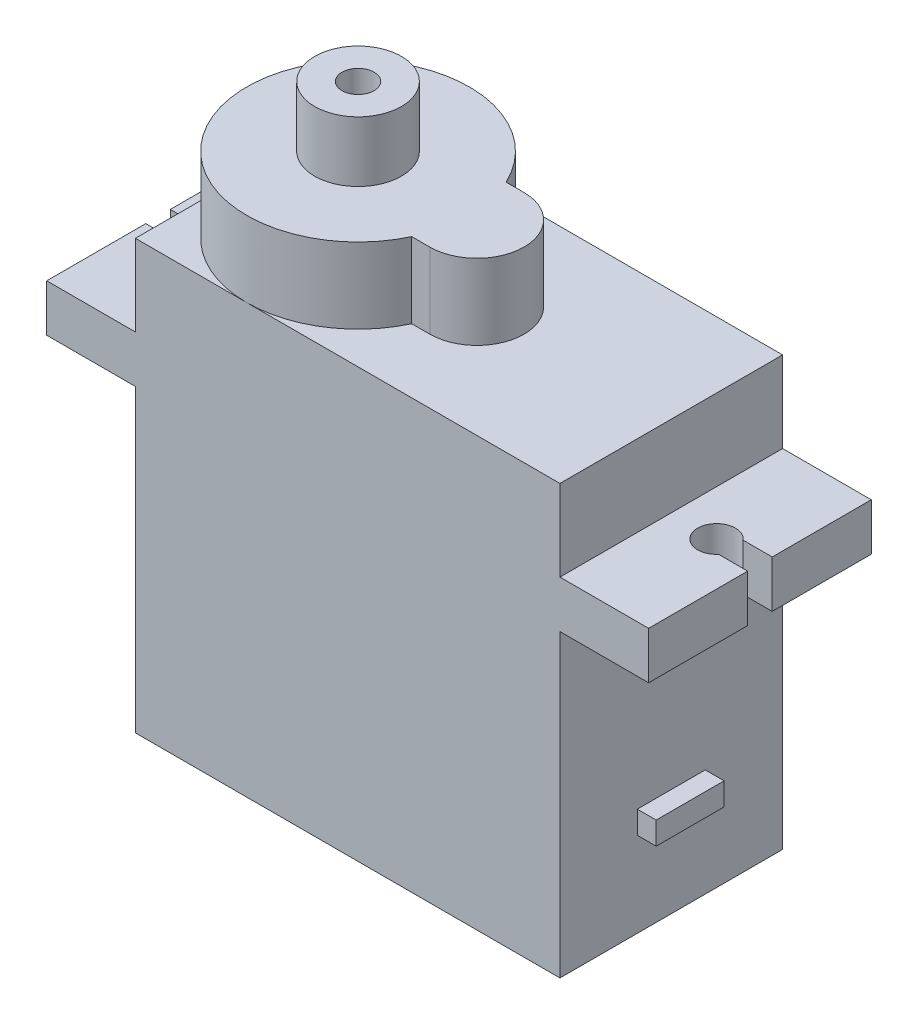
ISO-10303-21;
HEADER;
FILE_DESCRIPTION(('STEP AP214'),'2;1');
FILE_NAME('part.step','',(''),(''),'','','');
FILE_SCHEMA(('AUTOMOTIVE_DESIGN { 1 0 10303 214 1 1 1 1 }'));
ENDSEC;
DATA;
#1=APPLICATION_CONTEXT('core data for automotive mechanical design processes');
#2=APPLICATION_PROTOCOL_DEFINITION('international standard','automotive_design',2000,#1);
#3=PRODUCT_CONTEXT('',#1,'mechanical');
#4=PRODUCT('Part','Part','',(#3));
#5=PRODUCT_RELATED_PRODUCT_CATEGORY('part','',(#4));
#6=PRODUCT_DEFINITION_FORMATION('','',#4);
#7=PRODUCT_DEFINITION_CONTEXT('part definition',#1,'design');
#8=PRODUCT_DEFINITION('design','',#6,#7);
#9=PRODUCT_DEFINITION_SHAPE('','',#8);
#10=(LENGTH_UNIT() NAMED_UNIT(*) SI_UNIT(.MILLI.,.METRE.));
#11=(NAMED_UNIT(*) PLANE_ANGLE_UNIT() SI_UNIT($,.RADIAN.));
#12=(NAMED_UNIT(*) SI_UNIT($,.STERADIAN.) SOLID_ANGLE_UNIT());
#13=UNCERTAINTY_MEASURE_WITH_UNIT(LENGTH_MEASURE(1.E-05),#10,'distance_accuracy_value','');
#14=(GEOMETRIC_REPRESENTATION_CONTEXT(3) GLOBAL_UNCERTAINTY_ASSIGNED_CONTEXT((#13)) GLOBAL_UNIT_ASSIGNED_CONTEXT((#10,
#11,#12)) REPRESENTATION_CONTEXT('',''));
#15=CARTESIAN_POINT('',(0.,0.,0.));
#16=DIRECTION('',(0.,0.,1.));
#17=DIRECTION('',(1.,0.,0.));
#18=AXIS2_PLACEMENT_3D('',#15,#16,#17);
#19=CARTESIAN_POINT('',(11.25,22.7,5.9));
#20=DIRECTION('',(-1.,0.,0.));
#21=DIRECTION('',(0.,0.,1.));
#22=AXIS2_PLACEMENT_3D('',#19,#20,#21);
#23=PLANE('',#22);
#24=DIRECTION('',(0.,-1.,0.));
#25=VECTOR('',#24,1.);
#26=CARTESIAN_POINT('',(11.25,22.7,-5.9));
#27=LINE('',#26,#25);
#28=CARTESIAN_POINT('',(11.25,15.9,-5.9));
#29=VERTEX_POINT('',#28);
#30=CARTESIAN_POINT('',(11.25,0.,-5.9));
#31=VERTEX_POINT('',#30);
#32=EDGE_CURVE('E439',#29,#31,#27,.T.);
#33=ORIENTED_EDGE('',*,*,#32,.F.);
#34=DIRECTION('',(0.,0.,1.));
#35=VECTOR('',#34,1.);
#36=CARTESIAN_POINT('',(11.25,15.9,0.));
#37=LINE('',#36,#35);
#38=CARTESIAN_POINT('',(11.25,15.9,5.9));
#39=VERTEX_POINT('',#38);
#40=EDGE_CURVE('E384',#29,#39,#37,.T.);
#41=ORIENTED_EDGE('',*,*,#40,.T.);
#42=DIRECTION('',(0.,-1.,0.));
#43=VECTOR('',#42,1.);
#44=CARTESIAN_POINT('',(11.25,22.7,5.9));
#45=LINE('',#44,#43);
#46=CARTESIAN_POINT('',(11.25,0.,5.9));
#47=VERTEX_POINT('',#46);
#48=EDGE_CURVE('E419',#39,#47,#45,.T.);
#49=ORIENTED_EDGE('',*,*,#48,.T.);
#50=DIRECTION('',(0.,0.,-1.));
#51=VECTOR('',#50,1.);
#52=CARTESIAN_POINT('',(11.25,0.,5.9));
#53=LINE('',#52,#51);
#54=EDGE_CURVE('E402',#47,#31,#53,.T.);
#55=ORIENTED_EDGE('',*,*,#54,.T.);
#56=EDGE_LOOP('',(#33,#41,#49,#55));
#57=FACE_BOUND('',#56,.T.);
#58=DIRECTION('',(0.,1.,0.));
#59=VECTOR('',#58,1.);
#60=CARTESIAN_POINT('',(11.25,4.5,-1.8));
#61=LINE('',#60,#59);
#62=CARTESIAN_POINT('',(11.25,4.5,-1.8));
#63=VERTEX_POINT('',#62);
#64=CARTESIAN_POINT('',(11.25,5.7,-1.8));
#65=VERTEX_POINT('',#64);
#66=EDGE_CURVE('E247',#63,#65,#61,.T.);
#67=ORIENTED_EDGE('',*,*,#66,.F.);
#68=DIRECTION('',(0.,0.,-1.));
#69=VECTOR('',#68,1.);
#70=CARTESIAN_POINT('',(11.25,4.5,1.8));
#71=LINE('',#70,#69);
#72=CARTESIAN_POINT('',(11.25,4.5,1.8));
#73=VERTEX_POINT('',#72);
#74=EDGE_CURVE('E244',#73,#63,#71,.T.);
#75=ORIENTED_EDGE('',*,*,#74,.F.);
#76=DIRECTION('',(0.,-1.,0.));
#77=VECTOR('',#76,1.);
#78=CARTESIAN_POINT('',(11.25,4.5,1.8));
#79=LINE('',#78,#77);
#80=CARTESIAN_POINT('',(11.25,5.7,1.8));
#81=VERTEX_POINT('',#80);
#82=EDGE_CURVE('E53',#81,#73,#79,.T.);
#83=ORIENTED_EDGE('',*,*,#82,.F.);
#84=DIRECTION('',(0.,0.,1.));
#85=VECTOR('',#84,1.);
#86=CARTESIAN_POINT('',(11.25,5.7,1.8));
#87=LINE('',#86,#85);
#88=EDGE_CURVE('E48',#65,#81,#87,.T.);
#89=ORIENTED_EDGE('',*,*,#88,.F.);
#90=EDGE_LOOP('',(#67,#75,#83,#89));
#91=FACE_BOUND('',#90,.T.);
#92=ADVANCED_FACE('F34',(#57,#91),#23,.F.);
#93=CARTESIAN_POINT('',(0.,22.7,0.));
#94=DIRECTION('',(0.,-1.,0.));
#95=DIRECTION('',(0.,0.,-1.));
#96=AXIS2_PLACEMENT_3D('',#93,#94,#95);
#97=PLANE('',#96);
#98=CARTESIAN_POINT('',(-5.35,22.7,0.));
#99=DIRECTION('',(0.,1.,0.));
#100=DIRECTION('',(0.,0.,1.));
#101=AXIS2_PLACEMENT_3D('',#98,#99,#100);
#102=CIRCLE('',#101,5.9);
#103=CARTESIAN_POINT('',(-11.25,22.7,0.));
#104=VERTEX_POINT('',#103);
#105=CARTESIAN_POINT('',(-5.35,22.7,5.9));
#106=VERTEX_POINT('',#105);
#107=EDGE_CURVE('E41',#104,#106,#102,.T.);
#108=ORIENTED_EDGE('',*,*,#107,.F.);
#109=DIRECTION('',(0.,0.,1.));
#110=VECTOR('',#109,1.);
#111=CARTESIAN_POINT('',(-11.25,22.7,5.9));
#112=LINE('',#111,#110);
#113=CARTESIAN_POINT('',(-11.25,22.7,5.9));
#114=VERTEX_POINT('',#113);
#115=EDGE_CURVE('E411',#104,#114,#112,.T.);
#116=ORIENTED_EDGE('',*,*,#115,.T.);
#117=DIRECTION('',(1.,0.,0.));
#118=VECTOR('',#117,1.);
#119=CARTESIAN_POINT('',(-11.25,22.7,5.9));
#120=LINE('',#119,#118);
#121=EDGE_CURVE('E416',#114,#106,#120,.T.);
#122=ORIENTED_EDGE('',*,*,#121,.T.);
#123=EDGE_LOOP('',(#108,#116,#122));
#124=FACE_BOUND('',#123,.T.);
#125=ADVANCED_FACE('F538',(#124),#97,.F.);
#126=CARTESIAN_POINT('',(-0.00584431364504361,22.7,2.5));
#127=VERTEX_POINT('',#126);
#128=EDGE_CURVE('E446',#106,#127,#102,.T.);
#129=ORIENTED_EDGE('',*,*,#128,.F.);
#130=CARTESIAN_POINT('',(11.25,22.7,5.9));
#131=VERTEX_POINT('',#130);
#132=EDGE_CURVE('E415',#106,#131,#120,.T.);
#133=ORIENTED_EDGE('',*,*,#132,.T.);
#134=DIRECTION('',(0.,0.,-1.));
#135=VECTOR('',#134,1.);
#136=CARTESIAN_POINT('',(11.25,22.7,5.9));
#137=LINE('',#136,#135);
#138=CARTESIAN_POINT('',(11.25,22.7,-5.9));
#139=VERTEX_POINT('',#138);
#140=EDGE_CURVE('E403',#131,#139,#137,.T.);
#141=ORIENTED_EDGE('',*,*,#140,.T.);
#142=DIRECTION('',(-1.,0.,0.));
#143=VECTOR('',#142,1.);
#144=CARTESIAN_POINT('',(-11.25,22.7,-5.9));
#145=LINE('',#144,#143);
#146=CARTESIAN_POINT('',(-5.35,22.7,-5.9));
#147=VERTEX_POINT('',#146);
#148=EDGE_CURVE('E408',#139,#147,#145,.T.);
#149=ORIENTED_EDGE('',*,*,#148,.T.);
#150=CARTESIAN_POINT('',(-0.00584431364504361,22.7,-2.5));
#151=VERTEX_POINT('',#150);
#152=EDGE_CURVE('E280',#151,#147,#102,.T.);
#153=ORIENTED_EDGE('',*,*,#152,.F.);
#154=DIRECTION('',(-1.,0.,0.));
#155=VECTOR('',#154,1.);
#156=CARTESIAN_POINT('',(0.,22.7,-2.5));
#157=LINE('',#156,#155);
#158=CARTESIAN_POINT('',(0.95,22.7,-2.5));
#159=VERTEX_POINT('',#158);
#160=EDGE_CURVE('E277',#159,#151,#157,.T.);
#161=ORIENTED_EDGE('',*,*,#160,.F.);
#162=CARTESIAN_POINT('',(0.95,22.7,0.));
#163=DIRECTION('',(0.,1.,0.));
#164=DIRECTION('',(0.,0.,1.));
#165=AXIS2_PLACEMENT_3D('',#162,#163,#164);
#166=CIRCLE('',#165,2.5);
#167=CARTESIAN_POINT('',(0.95,22.7,2.5));
#168=VERTEX_POINT('',#167);
#169=EDGE_CURVE('E260',#168,#159,#166,.T.);
#170=ORIENTED_EDGE('',*,*,#169,.F.);
#171=DIRECTION('',(-1.,0.,0.));
#172=VECTOR('',#171,1.);
#173=CARTESIAN_POINT('',(0.,22.7,2.5));
#174=LINE('',#173,#172);
#175=EDGE_CURVE('E267',#168,#127,#174,.T.);
#176=ORIENTED_EDGE('',*,*,#175,.T.);
#177=EDGE_LOOP('',(#129,#133,#141,#149,#153,#161,#170,#176));
#178=FACE_BOUND('',#177,.T.);
#179=ADVANCED_FACE('F504',(#178),#97,.F.);
#180=EDGE_CURVE('E283',#147,#104,#102,.T.);
#181=ORIENTED_EDGE('',*,*,#180,.F.);
#182=CARTESIAN_POINT('',(-11.25,22.7,-5.9));
#183=VERTEX_POINT('',#182);
#184=EDGE_CURVE('E406',#147,#183,#145,.T.);
#185=ORIENTED_EDGE('',*,*,#184,.T.);
#186=EDGE_CURVE('E412',#183,#104,#112,.T.);
#187=ORIENTED_EDGE('',*,*,#186,.T.);
#188=EDGE_LOOP('',(#181,#185,#187));
#189=FACE_BOUND('',#188,.T.);
#190=ADVANCED_FACE('F496',(#189),#97,.F.);
#191=CARTESIAN_POINT('',(-11.25,22.7,5.9));
#192=DIRECTION('',(1.,0.,0.));
#193=DIRECTION('',(0.,0.,-1.));
#194=AXIS2_PLACEMENT_3D('',#191,#192,#193);
#195=PLANE('',#194);
#196=DIRECTION('',(0.,0.,1.));
#197=VECTOR('',#196,1.);
#198=CARTESIAN_POINT('',(-11.25,15.9,0.));
#199=LINE('',#198,#197);
#200=CARTESIAN_POINT('',(-11.25,15.9,-5.9));
#201=VERTEX_POINT('',#200);
#202=CARTESIAN_POINT('',(-11.25,15.9,5.9));
#203=VERTEX_POINT('',#202);
#204=EDGE_CURVE('E329',#201,#203,#199,.T.);
#205=ORIENTED_EDGE('',*,*,#204,.F.);
#206=DIRECTION('',(0.,-1.,0.));
#207=VECTOR('',#206,1.);
#208=CARTESIAN_POINT('',(-11.25,22.7,-5.9));
#209=LINE('',#208,#207);
#210=CARTESIAN_POINT('',(-11.25,0.,-5.9));
#211=VERTEX_POINT('',#210);
#212=EDGE_CURVE('E436',#201,#211,#209,.T.);
#213=ORIENTED_EDGE('',*,*,#212,.T.);
#214=DIRECTION('',(0.,0.,1.));
#215=VECTOR('',#214,1.);
#216=CARTESIAN_POINT('',(-11.25,0.,5.9));
#217=LINE('',#216,#215);
#218=CARTESIAN_POINT('',(-11.25,0.,5.9));
#219=VERTEX_POINT('',#218);
#220=EDGE_CURVE('E425',#211,#219,#217,.T.);
#221=ORIENTED_EDGE('',*,*,#220,.T.);
#222=DIRECTION('',(0.,-1.,0.));
#223=VECTOR('',#222,1.);
#224=CARTESIAN_POINT('',(-11.25,22.7,5.9));
#225=LINE('',#224,#223);
#226=EDGE_CURVE('E432',#203,#219,#225,.T.);
#227=ORIENTED_EDGE('',*,*,#226,.F.);
#228=EDGE_LOOP('',(#205,#213,#221,#227));
#229=FACE_BOUND('',#228,.T.);
#230=ADVANCED_FACE('F465',(#229),#195,.F.);
#231=DIRECTION('',(0.,0.,1.));
#232=VECTOR('',#231,1.);
#233=CARTESIAN_POINT('',(11.25,18.4,0.));
#234=LINE('',#233,#232);
#235=CARTESIAN_POINT('',(11.25,18.4,-5.9));
#236=VERTEX_POINT('',#235);
#237=CARTESIAN_POINT('',(11.25,18.4,5.9));
#238=VERTEX_POINT('',#237);
#239=EDGE_CURVE('E364',#236,#238,#234,.T.);
#240=ORIENTED_EDGE('',*,*,#239,.F.);
#241=EDGE_CURVE('E440',#139,#236,#27,.T.);
#242=ORIENTED_EDGE('',*,*,#241,.F.);
#243=ORIENTED_EDGE('',*,*,#140,.F.);
#244=EDGE_CURVE('E430',#131,#238,#45,.T.);
#245=ORIENTED_EDGE('',*,*,#244,.T.);
#246=EDGE_LOOP('',(#240,#242,#243,#245));
#247=FACE_BOUND('',#246,.T.);
#248=ADVANCED_FACE('F539',(#247),#23,.F.);
#249=CARTESIAN_POINT('',(-11.25,22.7,-5.9));
#250=DIRECTION('',(0.,0.,1.));
#251=DIRECTION('',(1.,0.,0.));
#252=AXIS2_PLACEMENT_3D('',#249,#250,#251);
#253=PLANE('',#252);
#254=DIRECTION('',(-1.,0.,0.));
#255=VECTOR('',#254,1.);
#256=CARTESIAN_POINT('',(-11.25,0.,-5.9));
#257=LINE('',#256,#255);
#258=EDGE_CURVE('E422',#31,#211,#257,.T.);
#259=ORIENTED_EDGE('',*,*,#258,.T.);
#260=ORIENTED_EDGE('',*,*,#212,.F.);
#261=DIRECTION('',(-1.,0.,0.));
#262=VECTOR('',#261,1.);
#263=CARTESIAN_POINT('',(0.,15.9,-5.9));
#264=LINE('',#263,#262);
#265=CARTESIAN_POINT('',(-15.95,15.9,-5.9));
#266=VERTEX_POINT('',#265);
#267=EDGE_CURVE('E332',#201,#266,#264,.T.);
#268=ORIENTED_EDGE('',*,*,#267,.T.);
#269=DIRECTION('',(0.,-1.,0.));
#270=VECTOR('',#269,1.);
#271=CARTESIAN_POINT('',(-15.95,18.4,-5.9));
#272=LINE('',#271,#270);
#273=CARTESIAN_POINT('',(-15.95,18.4,-5.9));
#274=VERTEX_POINT('',#273);
#275=EDGE_CURVE('E340',#274,#266,#272,.T.);
#276=ORIENTED_EDGE('',*,*,#275,.F.);
#277=DIRECTION('',(-1.,0.,0.));
#278=VECTOR('',#277,1.);
#279=CARTESIAN_POINT('',(0.,18.4,-5.9));
#280=LINE('',#279,#278);
#281=CARTESIAN_POINT('',(-11.25,18.4,-5.9));
#282=VERTEX_POINT('',#281);
#283=EDGE_CURVE('E312',#282,#274,#280,.T.);
#284=ORIENTED_EDGE('',*,*,#283,.F.);
#285=EDGE_CURVE('E437',#183,#282,#209,.T.);
#286=ORIENTED_EDGE('',*,*,#285,.F.);
#287=ORIENTED_EDGE('',*,*,#184,.F.);
#288=ORIENTED_EDGE('',*,*,#148,.F.);
#289=ORIENTED_EDGE('',*,*,#241,.T.);
#290=DIRECTION('',(1.,0.,0.));
#291=VECTOR('',#290,1.);
#292=CARTESIAN_POINT('',(0.,18.4,-5.9));
#293=LINE('',#292,#291);
#294=CARTESIAN_POINT('',(15.95,18.4,-5.9));
#295=VERTEX_POINT('',#294);
#296=EDGE_CURVE('E360',#236,#295,#293,.T.);
#297=ORIENTED_EDGE('',*,*,#296,.T.);
#298=DIRECTION('',(0.,-1.,0.));
#299=VECTOR('',#298,1.);
#300=CARTESIAN_POINT('',(15.95,18.4,-5.9));
#301=LINE('',#300,#299);
#302=CARTESIAN_POINT('',(15.95,15.9,-5.9));
#303=VERTEX_POINT('',#302);
#304=EDGE_CURVE('E396',#295,#303,#301,.T.);
#305=ORIENTED_EDGE('',*,*,#304,.T.);
#306=DIRECTION('',(1.,0.,0.));
#307=VECTOR('',#306,1.);
#308=CARTESIAN_POINT('',(0.,15.9,-5.9));
#309=LINE('',#308,#307);
#310=EDGE_CURVE('E380',#29,#303,#309,.T.);
#311=ORIENTED_EDGE('',*,*,#310,.F.);
#312=ORIENTED_EDGE('',*,*,#32,.T.);
#313=EDGE_LOOP('',(#259,#260,#268,#276,#284,#286,#287,#288,#289,#297,#305,#311,#312));
#314=FACE_BOUND('',#313,.T.);
#315=ADVANCED_FACE('F449',(#314),#253,.F.);
#316=ORIENTED_EDGE('',*,*,#285,.T.);
#317=DIRECTION('',(0.,0.,1.));
#318=VECTOR('',#317,1.);
#319=CARTESIAN_POINT('',(-11.25,18.4,0.));
#320=LINE('',#319,#318);
#321=CARTESIAN_POINT('',(-11.25,18.4,5.9));
#322=VERTEX_POINT('',#321);
#323=EDGE_CURVE('E309',#282,#322,#320,.T.);
#324=ORIENTED_EDGE('',*,*,#323,.T.);
#325=EDGE_CURVE('E433',#114,#322,#225,.T.);
#326=ORIENTED_EDGE('',*,*,#325,.F.);
#327=ORIENTED_EDGE('',*,*,#115,.F.);
#328=ORIENTED_EDGE('',*,*,#186,.F.);
#329=EDGE_LOOP('',(#316,#324,#326,#327,#328));
#330=FACE_BOUND('',#329,.T.);
#331=ADVANCED_FACE('F493',(#330),#195,.F.);
#332=CARTESIAN_POINT('',(-11.25,22.7,5.9));
#333=DIRECTION('',(0.,0.,-1.));
#334=DIRECTION('',(-1.,0.,0.));
#335=AXIS2_PLACEMENT_3D('',#332,#333,#334);
#336=PLANE('',#335);
#337=DIRECTION('',(1.,0.,0.));
#338=VECTOR('',#337,1.);
#339=CARTESIAN_POINT('',(-11.25,0.,5.9));
#340=LINE('',#339,#338);
#341=EDGE_CURVE('E407',#219,#47,#340,.T.);
#342=ORIENTED_EDGE('',*,*,#341,.T.);
#343=ORIENTED_EDGE('',*,*,#48,.F.);
#344=DIRECTION('',(1.,0.,0.));
#345=VECTOR('',#344,1.);
#346=CARTESIAN_POINT('',(0.,15.9,5.9));
#347=LINE('',#346,#345);
#348=CARTESIAN_POINT('',(15.95,15.9,5.9));
#349=VERTEX_POINT('',#348);
#350=EDGE_CURVE('E386',#39,#349,#347,.T.);
#351=ORIENTED_EDGE('',*,*,#350,.T.);
#352=DIRECTION('',(0.,-1.,0.));
#353=VECTOR('',#352,1.);
#354=CARTESIAN_POINT('',(15.95,18.4,5.9));
#355=LINE('',#354,#353);
#356=CARTESIAN_POINT('',(15.95,18.4,5.9));
#357=VERTEX_POINT('',#356);
#358=EDGE_CURVE('E394',#357,#349,#355,.T.);
#359=ORIENTED_EDGE('',*,*,#358,.F.);
#360=DIRECTION('',(1.,0.,0.));
#361=VECTOR('',#360,1.);
#362=CARTESIAN_POINT('',(0.,18.4,5.9));
#363=LINE('',#362,#361);
#364=EDGE_CURVE('E367',#238,#357,#363,.T.);
#365=ORIENTED_EDGE('',*,*,#364,.F.);
#366=ORIENTED_EDGE('',*,*,#244,.F.);
#367=ORIENTED_EDGE('',*,*,#132,.F.);
#368=ORIENTED_EDGE('',*,*,#121,.F.);
#369=ORIENTED_EDGE('',*,*,#325,.T.);
#370=DIRECTION('',(-1.,0.,0.));
#371=VECTOR('',#370,1.);
#372=CARTESIAN_POINT('',(0.,18.4,5.9));
#373=LINE('',#372,#371);
#374=CARTESIAN_POINT('',(-15.95,18.4,5.9));
#375=VERTEX_POINT('',#374);
#376=EDGE_CURVE('E305',#322,#375,#373,.T.);
#377=ORIENTED_EDGE('',*,*,#376,.T.);
#378=DIRECTION('',(0.,-1.,0.));
#379=VECTOR('',#378,1.);
#380=CARTESIAN_POINT('',(-15.95,18.4,5.9));
#381=LINE('',#380,#379);
#382=CARTESIAN_POINT('',(-15.95,15.9,5.9));
#383=VERTEX_POINT('',#382);
#384=EDGE_CURVE('E343',#375,#383,#381,.T.);
#385=ORIENTED_EDGE('',*,*,#384,.T.);
#386=DIRECTION('',(-1.,0.,0.));
#387=VECTOR('',#386,1.);
#388=CARTESIAN_POINT('',(0.,15.9,5.9));
#389=LINE('',#388,#387);
#390=EDGE_CURVE('E325',#203,#383,#389,.T.);
#391=ORIENTED_EDGE('',*,*,#390,.F.);
#392=ORIENTED_EDGE('',*,*,#226,.T.);
#393=EDGE_LOOP('',(#342,#343,#351,#359,#365,#366,#367,#368,#369,#377,#385,#391,#392));
#394=FACE_BOUND('',#393,.T.);
#395=ADVANCED_FACE('F461',(#394),#336,.F.);
#396=CARTESIAN_POINT('',(0.,0.,0.));
#397=DIRECTION('',(0.,-1.,0.));
#398=DIRECTION('',(0.,0.,-1.));
#399=AXIS2_PLACEMENT_3D('',#396,#397,#398);
#400=PLANE('',#399);
#401=ORIENTED_EDGE('',*,*,#54,.F.);
#402=ORIENTED_EDGE('',*,*,#341,.F.);
#403=ORIENTED_EDGE('',*,*,#220,.F.);
#404=ORIENTED_EDGE('',*,*,#258,.F.);
#405=EDGE_LOOP('',(#401,#402,#403,#404));
#406=FACE_BOUND('',#405,.T.);
#407=ADVANCED_FACE('F456',(#406),#400,.T.);
#408=CARTESIAN_POINT('',(13.65,18.4,0.));
#409=DIRECTION('',(0.,-1.,0.));
#410=DIRECTION('',(0.,0.,-1.));
#411=AXIS2_PLACEMENT_3D('',#408,#409,#410);
#412=CYLINDRICAL_SURFACE('',#411,1.);
#413=CARTESIAN_POINT('',(13.65,15.9,0.));
#414=DIRECTION('',(0.,1.,0.));
#415=DIRECTION('',(0.,0.,1.));
#416=AXIS2_PLACEMENT_3D('',#413,#414,#415);
#417=CIRCLE('',#416,1.);
#418=CARTESIAN_POINT('',(14.4099342076785,15.9,-0.65));
#419=VERTEX_POINT('',#418);
#420=CARTESIAN_POINT('',(14.4099342076785,15.9,0.65));
#421=VERTEX_POINT('',#420);
#422=EDGE_CURVE('E349',#419,#421,#417,.T.);
#423=ORIENTED_EDGE('',*,*,#422,.F.);
#424=DIRECTION('',(0.,-1.,0.));
#425=VECTOR('',#424,1.);
#426=CARTESIAN_POINT('',(14.4099342076785,18.4,-0.65));
#427=LINE('',#426,#425);
#428=CARTESIAN_POINT('',(14.4099342076785,18.4,-0.65));
#429=VERTEX_POINT('',#428);
#430=EDGE_CURVE('E400',#429,#419,#427,.T.);
#431=ORIENTED_EDGE('',*,*,#430,.F.);
#432=CARTESIAN_POINT('',(13.65,18.4,0.));
#433=DIRECTION('',(0.,1.,0.));
#434=DIRECTION('',(0.,0.,1.));
#435=AXIS2_PLACEMENT_3D('',#432,#433,#434);
#436=CIRCLE('',#435,1.);
#437=CARTESIAN_POINT('',(14.4099342076785,18.4,0.65));
#438=VERTEX_POINT('',#437);
#439=EDGE_CURVE('E350',#429,#438,#436,.T.);
#440=ORIENTED_EDGE('',*,*,#439,.T.);
#441=DIRECTION('',(0.,-1.,0.));
#442=VECTOR('',#441,1.);
#443=CARTESIAN_POINT('',(14.4099342076785,18.4,0.65));
#444=LINE('',#443,#442);
#445=EDGE_CURVE('E371',#438,#421,#444,.T.);
#446=ORIENTED_EDGE('',*,*,#445,.T.);
#447=EDGE_LOOP('',(#423,#431,#440,#446));
#448=FACE_BOUND('',#447,.T.);
#449=ADVANCED_FACE('F574',(#448),#412,.F.);
#450=CARTESIAN_POINT('',(0.,18.4,-0.65));
#451=DIRECTION('',(0.,0.,1.));
#452=DIRECTION('',(1.,0.,0.));
#453=AXIS2_PLACEMENT_3D('',#450,#451,#452);
#454=PLANE('',#453);
#455=DIRECTION('',(-1.,0.,0.));
#456=VECTOR('',#455,1.);
#457=CARTESIAN_POINT('',(0.,15.9,-0.65));
#458=LINE('',#457,#456);
#459=CARTESIAN_POINT('',(15.95,15.9,-0.65));
#460=VERTEX_POINT('',#459);
#461=EDGE_CURVE('E374',#460,#419,#458,.T.);
#462=ORIENTED_EDGE('',*,*,#461,.F.);
#463=DIRECTION('',(0.,-1.,0.));
#464=VECTOR('',#463,1.);
#465=CARTESIAN_POINT('',(15.95,18.4,-0.65));
#466=LINE('',#465,#464);
#467=CARTESIAN_POINT('',(15.95,18.4,-0.65));
#468=VERTEX_POINT('',#467);
#469=EDGE_CURVE('E398',#468,#460,#466,.T.);
#470=ORIENTED_EDGE('',*,*,#469,.F.);
#471=DIRECTION('',(-1.,0.,0.));
#472=VECTOR('',#471,1.);
#473=CARTESIAN_POINT('',(0.,18.4,-0.65));
#474=LINE('',#473,#472);
#475=EDGE_CURVE('E353',#468,#429,#474,.T.);
#476=ORIENTED_EDGE('',*,*,#475,.T.);
#477=ORIENTED_EDGE('',*,*,#430,.T.);
#478=EDGE_LOOP('',(#462,#470,#476,#477));
#479=FACE_BOUND('',#478,.T.);
#480=ADVANCED_FACE('F577',(#479),#454,.T.);
#481=CARTESIAN_POINT('',(15.95,18.4,0.));
#482=DIRECTION('',(1.,0.,0.));
#483=DIRECTION('',(0.,0.,-1.));
#484=AXIS2_PLACEMENT_3D('',#481,#482,#483);
#485=PLANE('',#484);
#486=DIRECTION('',(0.,0.,1.));
#487=VECTOR('',#486,1.);
#488=CARTESIAN_POINT('',(15.95,15.9,0.));
#489=LINE('',#488,#487);
#490=EDGE_CURVE('E377',#303,#460,#489,.T.);
#491=ORIENTED_EDGE('',*,*,#490,.F.);
#492=ORIENTED_EDGE('',*,*,#304,.F.);
#493=DIRECTION('',(0.,0.,1.));
#494=VECTOR('',#493,1.);
#495=CARTESIAN_POINT('',(15.95,18.4,0.));
#496=LINE('',#495,#494);
#497=EDGE_CURVE('E357',#295,#468,#496,.T.);
#498=ORIENTED_EDGE('',*,*,#497,.T.);
#499=ORIENTED_EDGE('',*,*,#469,.T.);
#500=EDGE_LOOP('',(#491,#492,#498,#499));
#501=FACE_BOUND('',#500,.T.);
#502=ADVANCED_FACE('F580',(#501),#485,.T.);
#503=CARTESIAN_POINT('',(15.95,15.9,0.65));
#504=VERTEX_POINT('',#503);
#505=EDGE_CURVE('E381',#504,#349,#489,.T.);
#506=ORIENTED_EDGE('',*,*,#505,.F.);
#507=DIRECTION('',(0.,-1.,0.));
#508=VECTOR('',#507,1.);
#509=CARTESIAN_POINT('',(15.95,18.4,0.65));
#510=LINE('',#509,#508);
#511=CARTESIAN_POINT('',(15.95,18.4,0.65));
#512=VERTEX_POINT('',#511);
#513=EDGE_CURVE('E392',#512,#504,#510,.T.);
#514=ORIENTED_EDGE('',*,*,#513,.F.);
#515=EDGE_CURVE('E361',#512,#357,#496,.T.);
#516=ORIENTED_EDGE('',*,*,#515,.T.);
#517=ORIENTED_EDGE('',*,*,#358,.T.);
#518=EDGE_LOOP('',(#506,#514,#516,#517));
#519=FACE_BOUND('',#518,.T.);
#520=ADVANCED_FACE('F565',(#519),#485,.T.);
#521=CARTESIAN_POINT('',(0.,18.4,0.65));
#522=DIRECTION('',(0.,0.,1.));
#523=DIRECTION('',(1.,0.,0.));
#524=AXIS2_PLACEMENT_3D('',#521,#522,#523);
#525=PLANE('',#524);
#526=DIRECTION('',(-1.,0.,0.));
#527=VECTOR('',#526,1.);
#528=CARTESIAN_POINT('',(0.,15.9,0.65));
#529=LINE('',#528,#527);
#530=EDGE_CURVE('E354',#504,#421,#529,.T.);
#531=ORIENTED_EDGE('',*,*,#530,.T.);
#532=ORIENTED_EDGE('',*,*,#445,.F.);
#533=DIRECTION('',(-1.,0.,0.));
#534=VECTOR('',#533,1.);
#535=CARTESIAN_POINT('',(0.,18.4,0.65));
#536=LINE('',#535,#534);
#537=EDGE_CURVE('E369',#512,#438,#536,.T.);
#538=ORIENTED_EDGE('',*,*,#537,.F.);
#539=ORIENTED_EDGE('',*,*,#513,.T.);
#540=EDGE_LOOP('',(#531,#532,#538,#539));
#541=FACE_BOUND('',#540,.T.);
#542=ADVANCED_FACE('F570',(#541),#525,.F.);
#543=CARTESIAN_POINT('',(0.,18.4,0.));
#544=DIRECTION('',(0.,1.,0.));
#545=DIRECTION('',(0.,0.,1.));
#546=AXIS2_PLACEMENT_3D('',#543,#544,#545);
#547=PLANE('',#546);
#548=ORIENTED_EDGE('',*,*,#439,.F.);
#549=ORIENTED_EDGE('',*,*,#475,.F.);
#550=ORIENTED_EDGE('',*,*,#497,.F.);
#551=ORIENTED_EDGE('',*,*,#296,.F.);
#552=ORIENTED_EDGE('',*,*,#239,.T.);
#553=ORIENTED_EDGE('',*,*,#364,.T.);
#554=ORIENTED_EDGE('',*,*,#515,.F.);
#555=ORIENTED_EDGE('',*,*,#537,.T.);
#556=EDGE_LOOP('',(#548,#549,#550,#551,#552,#553,#554,#555));
#557=FACE_BOUND('',#556,.T.);
#558=ADVANCED_FACE('F557',(#557),#547,.T.);
#559=CARTESIAN_POINT('',(0.,15.9,0.));
#560=DIRECTION('',(0.,1.,0.));
#561=DIRECTION('',(0.,0.,1.));
#562=AXIS2_PLACEMENT_3D('',#559,#560,#561);
#563=PLANE('',#562);
#564=ORIENTED_EDGE('',*,*,#422,.T.);
#565=ORIENTED_EDGE('',*,*,#530,.F.);
#566=ORIENTED_EDGE('',*,*,#505,.T.);
#567=ORIENTED_EDGE('',*,*,#350,.F.);
#568=ORIENTED_EDGE('',*,*,#40,.F.);
#569=ORIENTED_EDGE('',*,*,#310,.T.);
#570=ORIENTED_EDGE('',*,*,#490,.T.);
#571=ORIENTED_EDGE('',*,*,#461,.T.);
#572=EDGE_LOOP('',(#564,#565,#566,#567,#568,#569,#570,#571));
#573=FACE_BOUND('',#572,.T.);
#574=ADVANCED_FACE('F582',(#573),#563,.F.);
#575=CARTESIAN_POINT('',(-13.65,18.4,0.));
#576=DIRECTION('',(0.,-1.,0.));
#577=DIRECTION('',(0.,0.,-1.));
#578=AXIS2_PLACEMENT_3D('',#575,#576,#577);
#579=CYLINDRICAL_SURFACE('',#578,1.);
#580=CARTESIAN_POINT('',(-13.65,15.9,0.));
#581=DIRECTION('',(0.,-1.,0.));
#582=DIRECTION('',(0.,0.,1.));
#583=AXIS2_PLACEMENT_3D('',#580,#581,#582);
#584=CIRCLE('',#583,1.);
#585=CARTESIAN_POINT('',(-14.4099342076785,15.9,-0.65));
#586=VERTEX_POINT('',#585);
#587=CARTESIAN_POINT('',(-14.4099342076785,15.9,0.65));
#588=VERTEX_POINT('',#587);
#589=EDGE_CURVE('E296',#586,#588,#584,.T.);
#590=ORIENTED_EDGE('',*,*,#589,.T.);
#591=DIRECTION('',(0.,-1.,0.));
#592=VECTOR('',#591,1.);
#593=CARTESIAN_POINT('',(-14.4099342076785,18.4,0.65));
#594=LINE('',#593,#592);
#595=CARTESIAN_POINT('',(-14.4099342076785,18.4,0.65));
#596=VERTEX_POINT('',#595);
#597=EDGE_CURVE('E347',#596,#588,#594,.T.);
#598=ORIENTED_EDGE('',*,*,#597,.F.);
#599=CARTESIAN_POINT('',(-13.65,18.4,0.));
#600=DIRECTION('',(0.,-1.,0.));
#601=DIRECTION('',(0.,0.,1.));
#602=AXIS2_PLACEMENT_3D('',#599,#600,#601);
#603=CIRCLE('',#602,1.);
#604=CARTESIAN_POINT('',(-14.4099342076785,18.4,-0.65));
#605=VERTEX_POINT('',#604);
#606=EDGE_CURVE('E297',#605,#596,#603,.T.);
#607=ORIENTED_EDGE('',*,*,#606,.F.);
#608=DIRECTION('',(0.,-1.,0.));
#609=VECTOR('',#608,1.);
#610=CARTESIAN_POINT('',(-14.4099342076785,18.4,-0.65));
#611=LINE('',#610,#609);
#612=EDGE_CURVE('E316',#605,#586,#611,.T.);
#613=ORIENTED_EDGE('',*,*,#612,.T.);
#614=EDGE_LOOP('',(#590,#598,#607,#613));
#615=FACE_BOUND('',#614,.T.);
#616=ADVANCED_FACE('F482',(#615),#579,.F.);
#617=CARTESIAN_POINT('',(0.,18.4,0.65));
#618=DIRECTION('',(0.,0.,-1.));
#619=DIRECTION('',(-1.,0.,0.));
#620=AXIS2_PLACEMENT_3D('',#617,#618,#619);
#621=PLANE('',#620);
#622=DIRECTION('',(1.,0.,0.));
#623=VECTOR('',#622,1.);
#624=CARTESIAN_POINT('',(0.,15.9,0.65));
#625=LINE('',#624,#623);
#626=CARTESIAN_POINT('',(-15.95,15.9,0.65));
#627=VERTEX_POINT('',#626);
#628=EDGE_CURVE('E319',#627,#588,#625,.T.);
#629=ORIENTED_EDGE('',*,*,#628,.F.);
#630=DIRECTION('',(0.,-1.,0.));
#631=VECTOR('',#630,1.);
#632=CARTESIAN_POINT('',(-15.95,18.4,0.65));
#633=LINE('',#632,#631);
#634=CARTESIAN_POINT('',(-15.95,18.4,0.65));
#635=VERTEX_POINT('',#634);
#636=EDGE_CURVE('E345',#635,#627,#633,.T.);
#637=ORIENTED_EDGE('',*,*,#636,.F.);
#638=DIRECTION('',(1.,0.,0.));
#639=VECTOR('',#638,1.);
#640=CARTESIAN_POINT('',(0.,18.4,0.65));
#641=LINE('',#640,#639);
#642=EDGE_CURVE('E299',#635,#596,#641,.T.);
#643=ORIENTED_EDGE('',*,*,#642,.T.);
#644=ORIENTED_EDGE('',*,*,#597,.T.);
#645=EDGE_LOOP('',(#629,#637,#643,#644));
#646=FACE_BOUND('',#645,.T.);
#647=ADVANCED_FACE('F589',(#646),#621,.T.);
#648=CARTESIAN_POINT('',(-15.95,18.4,0.));
#649=DIRECTION('',(1.,0.,0.));
#650=DIRECTION('',(0.,0.,-1.));
#651=AXIS2_PLACEMENT_3D('',#648,#649,#650);
#652=PLANE('',#651);
#653=DIRECTION('',(0.,0.,1.));
#654=VECTOR('',#653,1.);
#655=CARTESIAN_POINT('',(-15.95,15.9,0.));
#656=LINE('',#655,#654);
#657=EDGE_CURVE('E322',#627,#383,#656,.T.);
#658=ORIENTED_EDGE('',*,*,#657,.T.);
#659=ORIENTED_EDGE('',*,*,#384,.F.);
#660=DIRECTION('',(0.,0.,1.));
#661=VECTOR('',#660,1.);
#662=CARTESIAN_POINT('',(-15.95,18.4,0.));
#663=LINE('',#662,#661);
#664=EDGE_CURVE('E303',#635,#375,#663,.T.);
#665=ORIENTED_EDGE('',*,*,#664,.F.);
#666=ORIENTED_EDGE('',*,*,#636,.T.);
#667=EDGE_LOOP('',(#658,#659,#665,#666));
#668=FACE_BOUND('',#667,.T.);
#669=ADVANCED_FACE('F670',(#668),#652,.F.);
#670=CARTESIAN_POINT('',(-15.95,15.9,-0.65));
#671=VERTEX_POINT('',#670);
#672=EDGE_CURVE('E326',#266,#671,#656,.T.);
#673=ORIENTED_EDGE('',*,*,#672,.T.);
#674=DIRECTION('',(0.,-1.,0.));
#675=VECTOR('',#674,1.);
#676=CARTESIAN_POINT('',(-15.95,18.4,-0.65));
#677=LINE('',#676,#675);
#678=CARTESIAN_POINT('',(-15.95,18.4,-0.65));
#679=VERTEX_POINT('',#678);
#680=EDGE_CURVE('E337',#679,#671,#677,.T.);
#681=ORIENTED_EDGE('',*,*,#680,.F.);
#682=EDGE_CURVE('E306',#274,#679,#663,.T.);
#683=ORIENTED_EDGE('',*,*,#682,.F.);
#684=ORIENTED_EDGE('',*,*,#275,.T.);
#685=EDGE_LOOP('',(#673,#681,#683,#684));
#686=FACE_BOUND('',#685,.T.);
#687=ADVANCED_FACE('F471',(#686),#652,.F.);
#688=CARTESIAN_POINT('',(0.,18.4,-0.65));
#689=DIRECTION('',(0.,0.,-1.));
#690=DIRECTION('',(-1.,0.,0.));
#691=AXIS2_PLACEMENT_3D('',#688,#689,#690);
#692=PLANE('',#691);
#693=DIRECTION('',(1.,0.,0.));
#694=VECTOR('',#693,1.);
#695=CARTESIAN_POINT('',(0.,15.9,-0.65));
#696=LINE('',#695,#694);
#697=EDGE_CURVE('E300',#671,#586,#696,.T.);
#698=ORIENTED_EDGE('',*,*,#697,.T.);
#699=ORIENTED_EDGE('',*,*,#612,.F.);
#700=DIRECTION('',(1.,0.,0.));
#701=VECTOR('',#700,1.);
#702=CARTESIAN_POINT('',(0.,18.4,-0.65));
#703=LINE('',#702,#701);
#704=EDGE_CURVE('E314',#679,#605,#703,.T.);
#705=ORIENTED_EDGE('',*,*,#704,.F.);
#706=ORIENTED_EDGE('',*,*,#680,.T.);
#707=EDGE_LOOP('',(#698,#699,#705,#706));
#708=FACE_BOUND('',#707,.T.);
#709=ADVANCED_FACE('F478',(#708),#692,.F.);
#710=CARTESIAN_POINT('',(0.,18.4,0.));
#711=DIRECTION('',(0.,1.,0.));
#712=DIRECTION('',(0.,0.,1.));
#713=AXIS2_PLACEMENT_3D('',#710,#711,#712);
#714=PLANE('',#713);
#715=ORIENTED_EDGE('',*,*,#606,.T.);
#716=ORIENTED_EDGE('',*,*,#642,.F.);
#717=ORIENTED_EDGE('',*,*,#664,.T.);
#718=ORIENTED_EDGE('',*,*,#376,.F.);
#719=ORIENTED_EDGE('',*,*,#323,.F.);
#720=ORIENTED_EDGE('',*,*,#283,.T.);
#721=ORIENTED_EDGE('',*,*,#682,.T.);
#722=ORIENTED_EDGE('',*,*,#704,.T.);
#723=EDGE_LOOP('',(#715,#716,#717,#718,#719,#720,#721,#722));
#724=FACE_BOUND('',#723,.T.);
#725=ADVANCED_FACE('F486',(#724),#714,.T.);
#726=CARTESIAN_POINT('',(0.,15.9,0.));
#727=DIRECTION('',(0.,1.,0.));
#728=DIRECTION('',(0.,0.,1.));
#729=AXIS2_PLACEMENT_3D('',#726,#727,#728);
#730=PLANE('',#729);
#731=ORIENTED_EDGE('',*,*,#589,.F.);
#732=ORIENTED_EDGE('',*,*,#697,.F.);
#733=ORIENTED_EDGE('',*,*,#672,.F.);
#734=ORIENTED_EDGE('',*,*,#267,.F.);
#735=ORIENTED_EDGE('',*,*,#204,.T.);
#736=ORIENTED_EDGE('',*,*,#390,.T.);
#737=ORIENTED_EDGE('',*,*,#657,.F.);
#738=ORIENTED_EDGE('',*,*,#628,.T.);
#739=EDGE_LOOP('',(#731,#732,#733,#734,#735,#736,#737,#738));
#740=FACE_BOUND('',#739,.T.);
#741=ADVANCED_FACE('F475',(#740),#730,.F.);
#742=CARTESIAN_POINT('',(0.95,26.7,0.));
#743=DIRECTION('',(0.,-1.,0.));
#744=DIRECTION('',(0.,0.,-1.));
#745=AXIS2_PLACEMENT_3D('',#742,#743,#744);
#746=CYLINDRICAL_SURFACE('',#745,2.5);
#747=ORIENTED_EDGE('',*,*,#169,.T.);
#748=DIRECTION('',(0.,-1.,0.));
#749=VECTOR('',#748,1.);
#750=CARTESIAN_POINT('',(0.95,26.7,-2.5));
#751=LINE('',#750,#749);
#752=CARTESIAN_POINT('',(0.95,26.7,-2.5));
#753=VERTEX_POINT('',#752);
#754=EDGE_CURVE('E293',#753,#159,#751,.T.);
#755=ORIENTED_EDGE('',*,*,#754,.F.);
#756=CARTESIAN_POINT('',(0.95,26.7,0.));
#757=DIRECTION('',(0.,1.,0.));
#758=DIRECTION('',(0.,0.,1.));
#759=AXIS2_PLACEMENT_3D('',#756,#757,#758);
#760=CIRCLE('',#759,2.5);
#761=CARTESIAN_POINT('',(0.95,26.7,2.5));
#762=VERTEX_POINT('',#761);
#763=EDGE_CURVE('E263',#762,#753,#760,.T.);
#764=ORIENTED_EDGE('',*,*,#763,.F.);
#765=DIRECTION('',(0.,-1.,0.));
#766=VECTOR('',#765,1.);
#767=CARTESIAN_POINT('',(0.95,26.7,2.5));
#768=LINE('',#767,#766);
#769=EDGE_CURVE('E274',#762,#168,#768,.T.);
#770=ORIENTED_EDGE('',*,*,#769,.T.);
#771=EDGE_LOOP('',(#747,#755,#764,#770));
#772=FACE_BOUND('',#771,.T.);
#773=ADVANCED_FACE('F510',(#772),#746,.T.);
#774=CARTESIAN_POINT('',(0.,26.7,-2.5));
#775=DIRECTION('',(0.,0.,1.));
#776=DIRECTION('',(1.,0.,0.));
#777=AXIS2_PLACEMENT_3D('',#774,#775,#776);
#778=PLANE('',#777);
#779=ORIENTED_EDGE('',*,*,#160,.T.);
#780=DIRECTION('',(0.,-1.,0.));
#781=VECTOR('',#780,1.);
#782=CARTESIAN_POINT('',(-0.00584431364504361,26.7,-2.5));
#783=LINE('',#782,#781);
#784=CARTESIAN_POINT('',(-0.00584431364504361,26.7,-2.5));
#785=VERTEX_POINT('',#784);
#786=EDGE_CURVE('E290',#785,#151,#783,.T.);
#787=ORIENTED_EDGE('',*,*,#786,.F.);
#788=DIRECTION('',(-1.,0.,0.));
#789=VECTOR('',#788,1.);
#790=CARTESIAN_POINT('',(0.,26.7,-2.5));
#791=LINE('',#790,#789);
#792=EDGE_CURVE('E266',#753,#785,#791,.T.);
#793=ORIENTED_EDGE('',*,*,#792,.F.);
#794=ORIENTED_EDGE('',*,*,#754,.T.);
#795=EDGE_LOOP('',(#779,#787,#793,#794));
#796=FACE_BOUND('',#795,.T.);
#797=ADVANCED_FACE('F506',(#796),#778,.F.);
#798=CARTESIAN_POINT('',(-5.35,26.7,0.));
#799=DIRECTION('',(0.,-1.,0.));
#800=DIRECTION('',(0.,0.,-1.));
#801=AXIS2_PLACEMENT_3D('',#798,#799,#800);
#802=CYLINDRICAL_SURFACE('',#801,5.9);
#803=ORIENTED_EDGE('',*,*,#152,.T.);
#804=ORIENTED_EDGE('',*,*,#180,.T.);
#805=ORIENTED_EDGE('',*,*,#107,.T.);
#806=ORIENTED_EDGE('',*,*,#128,.T.);
#807=DIRECTION('',(0.,-1.,0.));
#808=VECTOR('',#807,1.);
#809=CARTESIAN_POINT('',(-0.00584431364504361,26.7,2.5));
#810=LINE('',#809,#808);
#811=CARTESIAN_POINT('',(-0.00584431364504361,26.7,2.5));
#812=VERTEX_POINT('',#811);
#813=EDGE_CURVE('E287',#812,#127,#810,.T.);
#814=ORIENTED_EDGE('',*,*,#813,.F.);
#815=CARTESIAN_POINT('',(-5.35,26.7,0.));
#816=DIRECTION('',(0.,1.,0.));
#817=DIRECTION('',(0.,0.,1.));
#818=AXIS2_PLACEMENT_3D('',#815,#816,#817);
#819=CIRCLE('',#818,5.9);
#820=EDGE_CURVE('E269',#785,#812,#819,.T.);
#821=ORIENTED_EDGE('',*,*,#820,.F.);
#822=ORIENTED_EDGE('',*,*,#786,.T.);
#823=EDGE_LOOP('',(#803,#804,#805,#806,#814,#821,#822));
#824=FACE_BOUND('',#823,.T.);
#825=ADVANCED_FACE('F499',(#824),#802,.T.);
#826=CARTESIAN_POINT('',(0.,26.7,2.5));
#827=DIRECTION('',(0.,0.,1.));
#828=DIRECTION('',(1.,0.,0.));
#829=AXIS2_PLACEMENT_3D('',#826,#827,#828);
#830=PLANE('',#829);
#831=ORIENTED_EDGE('',*,*,#175,.F.);
#832=ORIENTED_EDGE('',*,*,#769,.F.);
#833=DIRECTION('',(-1.,0.,0.));
#834=VECTOR('',#833,1.);
#835=CARTESIAN_POINT('',(0.,26.7,2.5));
#836=LINE('',#835,#834);
#837=EDGE_CURVE('E271',#762,#812,#836,.T.);
#838=ORIENTED_EDGE('',*,*,#837,.T.);
#839=ORIENTED_EDGE('',*,*,#813,.T.);
#840=EDGE_LOOP('',(#831,#832,#838,#839));
#841=FACE_BOUND('',#840,.T.);
#842=ADVANCED_FACE('F515',(#841),#830,.T.);
#843=CARTESIAN_POINT('',(0.,26.7,0.));
#844=DIRECTION('',(0.,1.,0.));
#845=DIRECTION('',(0.,0.,1.));
#846=AXIS2_PLACEMENT_3D('',#843,#844,#845);
#847=PLANE('',#846);
#848=CARTESIAN_POINT('',(-5.35,26.7,0.));
#849=DIRECTION('',(0.,1.,0.));
#850=DIRECTION('',(0.,0.,1.));
#851=AXIS2_PLACEMENT_3D('',#848,#849,#850);
#852=CIRCLE('',#851,2.3);
#853=CARTESIAN_POINT('',(-5.35,26.7,2.3));
#854=VERTEX_POINT('',#853);
#855=EDGE_CURVE('E251',#854,#854,#852,.T.);
#856=ORIENTED_EDGE('',*,*,#855,.F.);
#857=EDGE_LOOP('',(#856));
#858=FACE_BOUND('',#857,.T.);
#859=ORIENTED_EDGE('',*,*,#763,.T.);
#860=ORIENTED_EDGE('',*,*,#792,.T.);
#861=ORIENTED_EDGE('',*,*,#820,.T.);
#862=ORIENTED_EDGE('',*,*,#837,.F.);
#863=EDGE_LOOP('',(#859,#860,#861,#862));
#864=FACE_BOUND('',#863,.T.);
#865=ADVANCED_FACE('F518',(#858,#864),#847,.T.);
#866=CARTESIAN_POINT('',(-5.35,29.9,0.));
#867=DIRECTION('',(0.,1.,0.));
#868=DIRECTION('',(0.,0.,1.));
#869=AXIS2_PLACEMENT_3D('',#866,#867,#868);
#870=PLANE('',#869);
#871=CARTESIAN_POINT('',(-5.35,29.9,0.));
#872=DIRECTION('',(0.,1.,0.));
#873=DIRECTION('',(0.,0.,1.));
#874=AXIS2_PLACEMENT_3D('',#871,#872,#873);
#875=CIRCLE('',#874,2.3);
#876=CARTESIAN_POINT('',(-5.35,29.9,2.3));
#877=VERTEX_POINT('',#876);
#878=EDGE_CURVE('E257',#877,#877,#875,.T.);
#879=ORIENTED_EDGE('',*,*,#878,.T.);
#880=EDGE_LOOP('',(#879));
#881=FACE_BOUND('',#880,.T.);
#882=CARTESIAN_POINT('',(-5.35,29.9,0.));
#883=DIRECTION('',(0.,1.,0.));
#884=DIRECTION('',(0.,0.,1.));
#885=AXIS2_PLACEMENT_3D('',#882,#883,#884);
#886=CIRCLE('',#885,0.85);
#887=CARTESIAN_POINT('',(-5.35,29.9,0.85));
#888=VERTEX_POINT('',#887);
#889=EDGE_CURVE('E248',#888,#888,#886,.T.);
#890=ORIENTED_EDGE('',*,*,#889,.F.);
#891=EDGE_LOOP('',(#890));
#892=FACE_BOUND('',#891,.T.);
#893=ADVANCED_FACE('F520',(#881,#892),#870,.T.);
#894=CARTESIAN_POINT('',(-5.35,29.9,0.));
#895=DIRECTION('',(0.,-1.,0.));
#896=DIRECTION('',(0.,0.,-1.));
#897=AXIS2_PLACEMENT_3D('',#894,#895,#896);
#898=CYLINDRICAL_SURFACE('',#897,2.3);
#899=ORIENTED_EDGE('',*,*,#878,.F.);
#900=EDGE_LOOP('',(#899));
#901=FACE_BOUND('',#900,.T.);
#902=ORIENTED_EDGE('',*,*,#855,.T.);
#903=EDGE_LOOP('',(#902));
#904=FACE_BOUND('',#903,.T.);
#905=ADVANCED_FACE('F528',(#901,#904),#898,.T.);
#906=CARTESIAN_POINT('',(-5.35,29.9,0.));
#907=DIRECTION('',(0.,-1.,0.));
#908=DIRECTION('',(0.,0.,-1.));
#909=AXIS2_PLACEMENT_3D('',#906,#907,#908);
#910=CYLINDRICAL_SURFACE('',#909,0.85);
#911=ORIENTED_EDGE('',*,*,#889,.T.);
#912=EDGE_LOOP('',(#911));
#913=FACE_BOUND('',#912,.T.);
#914=CARTESIAN_POINT('',(-5.35,26.7,0.));
#915=DIRECTION('',(0.,1.,0.));
#916=DIRECTION('',(0.,0.,1.));
#917=AXIS2_PLACEMENT_3D('',#914,#915,#916);
#918=CIRCLE('',#917,0.85);
#919=CARTESIAN_POINT('',(-5.35,26.7,0.85));
#920=VERTEX_POINT('',#919);
#921=EDGE_CURVE('E11',#920,#920,#918,.F.);
#922=ORIENTED_EDGE('',*,*,#921,.T.);
#923=EDGE_LOOP('',(#922));
#924=FACE_BOUND('',#923,.T.);
#925=ADVANCED_FACE('F535',(#913,#924),#910,.F.);
#926=ORIENTED_EDGE('',*,*,#921,.F.);
#927=EDGE_LOOP('',(#926));
#928=FACE_BOUND('',#927,.T.);
#929=ADVANCED_FACE('F523',(#928),#847,.T.);
#930=CARTESIAN_POINT('',(12.25,4.5,-1.8));
#931=DIRECTION('',(0.,0.,1.));
#932=DIRECTION('',(1.,0.,0.));
#933=AXIS2_PLACEMENT_3D('',#930,#931,#932);
#934=PLANE('',#933);
#935=ORIENTED_EDGE('',*,*,#66,.T.);
#936=DIRECTION('',(-1.,0.,0.));
#937=VECTOR('',#936,1.);
#938=CARTESIAN_POINT('',(12.25,5.7,-1.8));
#939=LINE('',#938,#937);
#940=CARTESIAN_POINT('',(12.25,5.7,-1.8));
#941=VERTEX_POINT('',#940);
#942=EDGE_CURVE('E228',#941,#65,#939,.T.);
#943=ORIENTED_EDGE('',*,*,#942,.F.);
#944=DIRECTION('',(0.,1.,0.));
#945=VECTOR('',#944,1.);
#946=CARTESIAN_POINT('',(12.25,4.5,-1.8));
#947=LINE('',#946,#945);
#948=CARTESIAN_POINT('',(12.25,4.5,-1.8));
#949=VERTEX_POINT('',#948);
#950=EDGE_CURVE('E235',#949,#941,#947,.T.);
#951=ORIENTED_EDGE('',*,*,#950,.F.);
#952=DIRECTION('',(-1.,0.,0.));
#953=VECTOR('',#952,1.);
#954=CARTESIAN_POINT('',(12.25,4.5,-1.8));
#955=LINE('',#954,#953);
#956=EDGE_CURVE('E907',#949,#63,#955,.T.);
#957=ORIENTED_EDGE('',*,*,#956,.T.);
#958=EDGE_LOOP('',(#935,#943,#951,#957));
#959=FACE_BOUND('',#958,.T.);
#960=ADVANCED_FACE('F246',(#959),#934,.F.);
#961=CARTESIAN_POINT('',(12.25,5.7,1.8));
#962=DIRECTION('',(0.,-1.,0.));
#963=DIRECTION('',(0.,0.,-1.));
#964=AXIS2_PLACEMENT_3D('',#961,#962,#963);
#965=PLANE('',#964);
#966=ORIENTED_EDGE('',*,*,#88,.T.);
#967=DIRECTION('',(-1.,0.,0.));
#968=VECTOR('',#967,1.);
#969=CARTESIAN_POINT('',(12.25,5.7,1.8));
#970=LINE('',#969,#968);
#971=CARTESIAN_POINT('',(12.25,5.7,1.8));
#972=VERTEX_POINT('',#971);
#973=EDGE_CURVE('E231',#972,#81,#970,.T.);
#974=ORIENTED_EDGE('',*,*,#973,.F.);
#975=DIRECTION('',(0.,0.,1.));
#976=VECTOR('',#975,1.);
#977=CARTESIAN_POINT('',(12.25,5.7,1.8));
#978=LINE('',#977,#976);
#979=EDGE_CURVE('E224',#941,#972,#978,.T.);
#980=ORIENTED_EDGE('',*,*,#979,.F.);
#981=ORIENTED_EDGE('',*,*,#942,.T.);
#982=EDGE_LOOP('',(#966,#974,#980,#981));
#983=FACE_BOUND('',#982,.T.);
#984=ADVANCED_FACE('F226',(#983),#965,.F.);
#985=CARTESIAN_POINT('',(12.25,4.5,1.8));
#986=DIRECTION('',(0.,0.,-1.));
#987=DIRECTION('',(0.,1.,0.));
#988=AXIS2_PLACEMENT_3D('',#985,#986,#987);
#989=PLANE('',#988);
#990=ORIENTED_EDGE('',*,*,#82,.T.);
#991=DIRECTION('',(-1.,0.,0.));
#992=VECTOR('',#991,1.);
#993=CARTESIAN_POINT('',(12.25,4.5,1.8));
#994=LINE('',#993,#992);
#995=CARTESIAN_POINT('',(12.25,4.5,1.8));
#996=VERTEX_POINT('',#995);
#997=EDGE_CURVE('E253',#996,#73,#994,.T.);
#998=ORIENTED_EDGE('',*,*,#997,.F.);
#999=DIRECTION('',(0.,-1.,0.));
#1000=VECTOR('',#999,1.);
#1001=CARTESIAN_POINT('',(12.25,4.5,1.8));
#1002=LINE('',#1001,#1000);
#1003=EDGE_CURVE('E234',#972,#996,#1002,.T.);
#1004=ORIENTED_EDGE('',*,*,#1003,.F.);
#1005=ORIENTED_EDGE('',*,*,#973,.T.);
#1006=EDGE_LOOP('',(#990,#998,#1004,#1005));
#1007=FACE_BOUND('',#1006,.T.);
#1008=ADVANCED_FACE('F870',(#1007),#989,.F.);
#1009=CARTESIAN_POINT('',(12.25,4.5,1.8));
#1010=DIRECTION('',(0.,1.,0.));
#1011=DIRECTION('',(0.,0.,1.));
#1012=AXIS2_PLACEMENT_3D('',#1009,#1010,#1011);
#1013=PLANE('',#1012);
#1014=ORIENTED_EDGE('',*,*,#74,.T.);
#1015=ORIENTED_EDGE('',*,*,#956,.F.);
#1016=DIRECTION('',(0.,0.,-1.));
#1017=VECTOR('',#1016,1.);
#1018=CARTESIAN_POINT('',(12.25,4.5,1.8));
#1019=LINE('',#1018,#1017);
#1020=EDGE_CURVE('E240',#996,#949,#1019,.T.);
#1021=ORIENTED_EDGE('',*,*,#1020,.F.);
#1022=ORIENTED_EDGE('',*,*,#997,.T.);
#1023=EDGE_LOOP('',(#1014,#1015,#1021,#1022));
#1024=FACE_BOUND('',#1023,.T.);
#1025=ADVANCED_FACE('F878',(#1024),#1013,.F.);
#1026=CARTESIAN_POINT('',(12.25,0.,0.));
#1027=DIRECTION('',(-1.,0.,0.));
#1028=DIRECTION('',(0.,0.,1.));
#1029=AXIS2_PLACEMENT_3D('',#1026,#1027,#1028);
#1030=PLANE('',#1029);
#1031=ORIENTED_EDGE('',*,*,#950,.T.);
#1032=ORIENTED_EDGE('',*,*,#979,.T.);
#1033=ORIENTED_EDGE('',*,*,#1003,.T.);
#1034=ORIENTED_EDGE('',*,*,#1020,.T.);
#1035=EDGE_LOOP('',(#1031,#1032,#1033,#1034));
#1036=FACE_BOUND('',#1035,.T.);
#1037=ADVANCED_FACE('F238',(#1036),#1030,.F.);
#1038=CLOSED_SHELL('',(#92,#125,#179,#190,#230,#248,#315,#331,#395,#407,#449,#480,#502,#520,
#542,#558,#574,#616,#647,#669,#687,#709,#725,#741,#773,#797,#825,#842,#865,#893,#905,#925,#929,
#960,#984,#1008,#1025,#1037));
#1039=MANIFOLD_SOLID_BREP('B2',#1038);
#1040=ADVANCED_BREP_SHAPE_REPRESENTATION('',(#18,#1039),#14);
#1041=SHAPE_DEFINITION_REPRESENTATION(#9,#1040);
ENDSEC;
END-ISO-10303-21;
